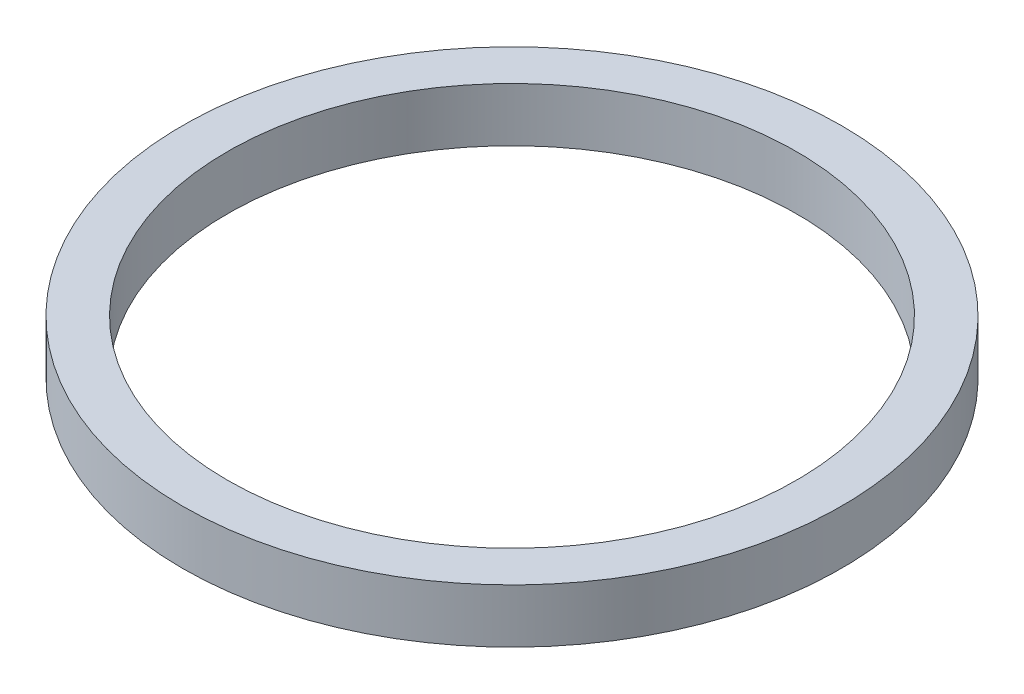
ISO-10303-21;
HEADER;
FILE_DESCRIPTION(('STEP AP214'),'2;1');
FILE_NAME('part.step','',(''),(''),'','','');
FILE_SCHEMA(('AUTOMOTIVE_DESIGN { 1 0 10303 214 1 1 1 1 }'));
ENDSEC;
DATA;
#1=APPLICATION_CONTEXT('core data for automotive mechanical design processes');
#2=APPLICATION_PROTOCOL_DEFINITION('international standard','automotive_design',2000,#1);
#3=PRODUCT_CONTEXT('',#1,'mechanical');
#4=PRODUCT('Part','Part','',(#3));
#5=PRODUCT_RELATED_PRODUCT_CATEGORY('part','',(#4));
#6=PRODUCT_DEFINITION_FORMATION('','',#4);
#7=PRODUCT_DEFINITION_CONTEXT('part definition',#1,'design');
#8=PRODUCT_DEFINITION('design','',#6,#7);
#9=PRODUCT_DEFINITION_SHAPE('','',#8);
#10=(LENGTH_UNIT() NAMED_UNIT(*) SI_UNIT(.MILLI.,.METRE.));
#11=(NAMED_UNIT(*) PLANE_ANGLE_UNIT() SI_UNIT($,.RADIAN.));
#12=(NAMED_UNIT(*) SI_UNIT($,.STERADIAN.) SOLID_ANGLE_UNIT());
#13=UNCERTAINTY_MEASURE_WITH_UNIT(LENGTH_MEASURE(1.E-05),#10,'distance_accuracy_value','');
#14=(GEOMETRIC_REPRESENTATION_CONTEXT(3) GLOBAL_UNCERTAINTY_ASSIGNED_CONTEXT((#13)) GLOBAL_UNIT_ASSIGNED_CONTEXT((#10,
#11,#12)) REPRESENTATION_CONTEXT('',''));
#15=CARTESIAN_POINT('',(0.,0.,0.));
#16=DIRECTION('',(0.,0.,1.));
#17=DIRECTION('',(1.,0.,0.));
#18=AXIS2_PLACEMENT_3D('',#15,#16,#17);
#19=CARTESIAN_POINT('',(0.,9.,0.));
#20=DIRECTION('',(0.,-1.,0.));
#21=DIRECTION('',(0.,0.,-1.));
#22=AXIS2_PLACEMENT_3D('',#19,#20,#21);
#23=CYLINDRICAL_SURFACE('',#22,55.);
#24=CARTESIAN_POINT('',(0.,9.,0.));
#25=DIRECTION('',(0.,1.,0.));
#26=DIRECTION('',(0.,0.,1.));
#27=AXIS2_PLACEMENT_3D('',#24,#25,#26);
#28=CIRCLE('',#27,55.);
#29=CARTESIAN_POINT('',(0.,9.,55.));
#30=VERTEX_POINT('',#29);
#31=EDGE_CURVE('E10',#30,#30,#28,.T.);
#32=ORIENTED_EDGE('',*,*,#31,.F.);
#33=EDGE_LOOP('',(#32));
#34=FACE_BOUND('',#33,.T.);
#35=CARTESIAN_POINT('',(0.,0.,0.));
#36=DIRECTION('',(0.,1.,0.));
#37=DIRECTION('',(0.,0.,1.));
#38=AXIS2_PLACEMENT_3D('',#35,#36,#37);
#39=CIRCLE('',#38,55.);
#40=CARTESIAN_POINT('',(0.,0.,55.));
#41=VERTEX_POINT('',#40);
#42=EDGE_CURVE('E37',#41,#41,#39,.T.);
#43=ORIENTED_EDGE('',*,*,#42,.T.);
#44=EDGE_LOOP('',(#43));
#45=FACE_BOUND('',#44,.T.);
#46=ADVANCED_FACE('F40',(#34,#45),#23,.T.);
#47=CARTESIAN_POINT('',(0.,9.,0.));
#48=DIRECTION('',(0.,1.,0.));
#49=DIRECTION('',(0.,0.,1.));
#50=AXIS2_PLACEMENT_3D('',#47,#48,#49);
#51=PLANE('',#50);
#52=CARTESIAN_POINT('',(0.,9.,0.));
#53=DIRECTION('',(0.,1.,0.));
#54=DIRECTION('',(0.,0.,1.));
#55=AXIS2_PLACEMENT_3D('',#52,#53,#54);
#56=CIRCLE('',#55,47.5);
#57=CARTESIAN_POINT('',(0.,9.,47.5));
#58=VERTEX_POINT('',#57);
#59=EDGE_CURVE('E50',#58,#58,#56,.T.);
#60=ORIENTED_EDGE('',*,*,#59,.F.);
#61=EDGE_LOOP('',(#60));
#62=FACE_BOUND('',#61,.T.);
#63=ORIENTED_EDGE('',*,*,#31,.T.);
#64=EDGE_LOOP('',(#63));
#65=FACE_BOUND('',#64,.T.);
#66=ADVANCED_FACE('F59',(#62,#65),#51,.T.);
#67=CARTESIAN_POINT('',(0.,0.,0.));
#68=DIRECTION('',(0.,1.,0.));
#69=DIRECTION('',(0.,0.,1.));
#70=AXIS2_PLACEMENT_3D('',#67,#68,#69);
#71=PLANE('',#70);
#72=CARTESIAN_POINT('',(0.,0.,0.));
#73=DIRECTION('',(0.,1.,0.));
#74=DIRECTION('',(0.,0.,1.));
#75=AXIS2_PLACEMENT_3D('',#72,#73,#74);
#76=CIRCLE('',#75,47.5);
#77=CARTESIAN_POINT('',(0.,0.,47.5));
#78=VERTEX_POINT('',#77);
#79=EDGE_CURVE('E47',#78,#78,#76,.T.);
#80=ORIENTED_EDGE('',*,*,#79,.T.);
#81=EDGE_LOOP('',(#80));
#82=FACE_BOUND('',#81,.T.);
#83=ORIENTED_EDGE('',*,*,#42,.F.);
#84=EDGE_LOOP('',(#83));
#85=FACE_BOUND('',#84,.T.);
#86=ADVANCED_FACE('F58',(#82,#85),#71,.F.);
#87=CARTESIAN_POINT('',(0.,9.,0.));
#88=DIRECTION('',(0.,-1.,0.));
#89=DIRECTION('',(0.,0.,-1.));
#90=AXIS2_PLACEMENT_3D('',#87,#88,#89);
#91=CYLINDRICAL_SURFACE('',#90,47.5);
#92=ORIENTED_EDGE('',*,*,#59,.T.);
#93=EDGE_LOOP('',(#92));
#94=FACE_BOUND('',#93,.T.);
#95=ORIENTED_EDGE('',*,*,#79,.F.);
#96=EDGE_LOOP('',(#95));
#97=FACE_BOUND('',#96,.T.);
#98=ADVANCED_FACE('F54',(#94,#97),#91,.F.);
#99=CLOSED_SHELL('',(#46,#66,#86,#98));
#100=MANIFOLD_SOLID_BREP('B2',#99);
#101=ADVANCED_BREP_SHAPE_REPRESENTATION('',(#18,#100),#14);
#102=SHAPE_DEFINITION_REPRESENTATION(#9,#101);
ENDSEC;
END-ISO-10303-21;
